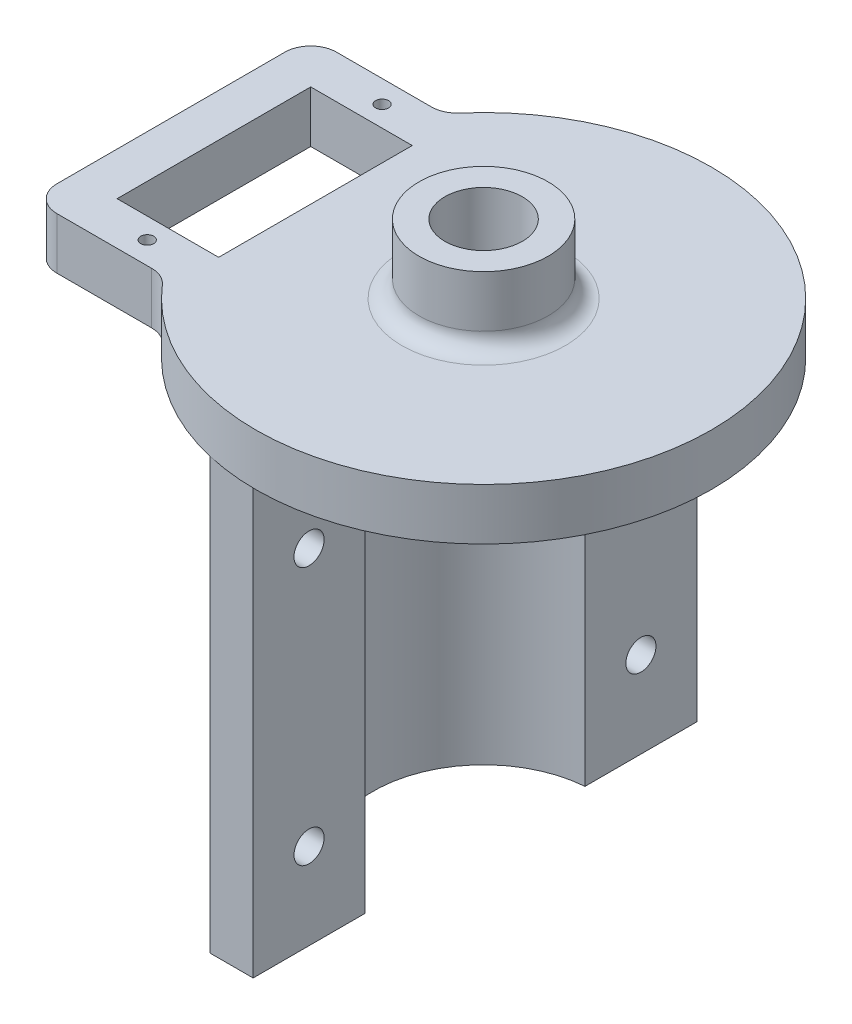
ISO-10303-21;
HEADER;
FILE_DESCRIPTION(('STEP AP214'),'2;1');
FILE_NAME('part.step','',(''),(''),'','','');
FILE_SCHEMA(('AUTOMOTIVE_DESIGN { 1 0 10303 214 1 1 1 1 }'));
ENDSEC;
DATA;
#1=APPLICATION_CONTEXT('core data for automotive mechanical design processes');
#2=APPLICATION_PROTOCOL_DEFINITION('international standard','automotive_design',2000,#1);
#3=PRODUCT_CONTEXT('',#1,'mechanical');
#4=PRODUCT('Part','Part','',(#3));
#5=PRODUCT_RELATED_PRODUCT_CATEGORY('part','',(#4));
#6=PRODUCT_DEFINITION_FORMATION('','',#4);
#7=PRODUCT_DEFINITION_CONTEXT('part definition',#1,'design');
#8=PRODUCT_DEFINITION('design','',#6,#7);
#9=PRODUCT_DEFINITION_SHAPE('','',#8);
#10=(LENGTH_UNIT() NAMED_UNIT(*) SI_UNIT(.MILLI.,.METRE.));
#11=(NAMED_UNIT(*) PLANE_ANGLE_UNIT() SI_UNIT($,.RADIAN.));
#12=(NAMED_UNIT(*) SI_UNIT($,.STERADIAN.) SOLID_ANGLE_UNIT());
#13=UNCERTAINTY_MEASURE_WITH_UNIT(LENGTH_MEASURE(1.E-05),#10,'distance_accuracy_value','');
#14=(GEOMETRIC_REPRESENTATION_CONTEXT(3) GLOBAL_UNCERTAINTY_ASSIGNED_CONTEXT((#13)) GLOBAL_UNIT_ASSIGNED_CONTEXT((#10,
#11,#12)) REPRESENTATION_CONTEXT('',''));
#15=CARTESIAN_POINT('',(0.,0.,0.));
#16=DIRECTION('',(0.,0.,1.));
#17=DIRECTION('',(1.,0.,0.));
#18=AXIS2_PLACEMENT_3D('',#15,#16,#17);
#19=CARTESIAN_POINT('',(-1.,-50.,25.7848331835619));
#20=DIRECTION('',(0.,0.,-1.));
#21=DIRECTION('',(-1.,0.,0.));
#22=AXIS2_PLACEMENT_3D('',#19,#20,#21);
#23=PLANE('',#22);
#24=DIRECTION('',(-1.,0.,0.));
#25=VECTOR('',#24,1.);
#26=CARTESIAN_POINT('',(-1.,0.,25.7848331835619));
#27=LINE('',#26,#25);
#28=CARTESIAN_POINT('',(-1.,0.,25.7848331835619));
#29=VERTEX_POINT('',#28);
#30=CARTESIAN_POINT('',(-6.,0.,25.7848331835619));
#31=VERTEX_POINT('',#30);
#32=EDGE_CURVE('E353',#29,#31,#27,.T.);
#33=ORIENTED_EDGE('',*,*,#32,.T.);
#34=DIRECTION('',(0.,1.,0.));
#35=VECTOR('',#34,1.);
#36=CARTESIAN_POINT('',(-6.,-50.,25.7848331835619));
#37=LINE('',#36,#35);
#38=CARTESIAN_POINT('',(-6.,-50.,25.7848331835619));
#39=VERTEX_POINT('',#38);
#40=EDGE_CURVE('E436',#39,#31,#37,.T.);
#41=ORIENTED_EDGE('',*,*,#40,.F.);
#42=DIRECTION('',(-1.,0.,0.));
#43=VECTOR('',#42,1.);
#44=CARTESIAN_POINT('',(-1.,-50.,25.7848331835619));
#45=LINE('',#44,#43);
#46=CARTESIAN_POINT('',(-1.,-50.,25.7848331835619));
#47=VERTEX_POINT('',#46);
#48=EDGE_CURVE('E354',#47,#39,#45,.T.);
#49=ORIENTED_EDGE('',*,*,#48,.F.);
#50=DIRECTION('',(0.,1.,0.));
#51=VECTOR('',#50,1.);
#52=CARTESIAN_POINT('',(-1.,-50.,25.7848331835619));
#53=LINE('',#52,#51);
#54=EDGE_CURVE('E378',#47,#29,#53,.T.);
#55=ORIENTED_EDGE('',*,*,#54,.T.);
#56=EDGE_LOOP('',(#33,#41,#49,#55));
#57=FACE_BOUND('',#56,.T.);
#58=ADVANCED_FACE('F45',(#57),#23,.F.);
#59=CARTESIAN_POINT('',(-6.,-50.,25.7848331835619));
#60=DIRECTION('',(1.,0.,0.));
#61=DIRECTION('',(0.,0.,-1.));
#62=AXIS2_PLACEMENT_3D('',#59,#60,#61);
#63=PLANE('',#62);
#64=CARTESIAN_POINT('',(-6.,-40.,19.2853936956035));
#65=DIRECTION('',(1.,0.,0.));
#66=DIRECTION('',(0.,0.,-1.));
#67=AXIS2_PLACEMENT_3D('',#64,#65,#66);
#68=CIRCLE('',#67,1.75);
#69=CARTESIAN_POINT('',(-6.,-40.,17.5353936956035));
#70=VERTEX_POINT('',#69);
#71=EDGE_CURVE('E341',#70,#70,#68,.T.);
#72=ORIENTED_EDGE('',*,*,#71,.T.);
#73=EDGE_LOOP('',(#72));
#74=FACE_BOUND('',#73,.T.);
#75=CARTESIAN_POINT('',(-6.,-10.,19.2853936956035));
#76=DIRECTION('',(1.,0.,0.));
#77=DIRECTION('',(0.,0.,-1.));
#78=AXIS2_PLACEMENT_3D('',#75,#76,#77);
#79=CIRCLE('',#78,1.75);
#80=CARTESIAN_POINT('',(-6.,-10.,17.5353936956035));
#81=VERTEX_POINT('',#80);
#82=EDGE_CURVE('E337',#81,#81,#79,.T.);
#83=ORIENTED_EDGE('',*,*,#82,.T.);
#84=EDGE_LOOP('',(#83));
#85=FACE_BOUND('',#84,.T.);
#86=DIRECTION('',(0.,0.,-1.));
#87=VECTOR('',#86,1.);
#88=CARTESIAN_POINT('',(-6.,0.,25.7848331835619));
#89=LINE('',#88,#87);
#90=CARTESIAN_POINT('',(-5.99999999999999,0.,16.7848331835619));
#91=VERTEX_POINT('',#90);
#92=EDGE_CURVE('E382',#31,#91,#89,.T.);
#93=ORIENTED_EDGE('',*,*,#92,.T.);
#94=DIRECTION('',(0.,1.,0.));
#95=VECTOR('',#94,1.);
#96=CARTESIAN_POINT('',(-5.99999999999999,-50.,16.7848331835619));
#97=LINE('',#96,#95);
#98=CARTESIAN_POINT('',(-5.99999999999999,-50.,16.7848331835619));
#99=VERTEX_POINT('',#98);
#100=EDGE_CURVE('E432',#99,#91,#97,.T.);
#101=ORIENTED_EDGE('',*,*,#100,.F.);
#102=DIRECTION('',(0.,0.,-1.));
#103=VECTOR('',#102,1.);
#104=CARTESIAN_POINT('',(-6.,-50.,25.7848331835619));
#105=LINE('',#104,#103);
#106=EDGE_CURVE('E357',#39,#99,#105,.T.);
#107=ORIENTED_EDGE('',*,*,#106,.F.);
#108=ORIENTED_EDGE('',*,*,#40,.T.);
#109=EDGE_LOOP('',(#93,#101,#107,#108));
#110=FACE_BOUND('',#109,.T.);
#111=ADVANCED_FACE('F462',(#74,#85,#110),#63,.F.);
#112=CARTESIAN_POINT('',(0.,-50.,0.));
#113=DIRECTION('',(0.,1.,0.));
#114=DIRECTION('',(0.,0.,1.));
#115=AXIS2_PLACEMENT_3D('',#112,#113,#114);
#116=CYLINDRICAL_SURFACE('',#115,17.825);
#117=CARTESIAN_POINT('',(0.,0.,0.));
#118=DIRECTION('',(0.,-1.,0.));
#119=DIRECTION('',(0.,0.,-1.));
#120=AXIS2_PLACEMENT_3D('',#117,#118,#119);
#121=CIRCLE('',#120,17.825);
#122=CARTESIAN_POINT('',(-6.,0.,-16.7848331835619));
#123=VERTEX_POINT('',#122);
#124=EDGE_CURVE('E386',#91,#123,#121,.T.);
#125=ORIENTED_EDGE('',*,*,#124,.T.);
#126=DIRECTION('',(0.,1.,0.));
#127=VECTOR('',#126,1.);
#128=CARTESIAN_POINT('',(-6.,-50.,-16.7848331835619));
#129=LINE('',#128,#127);
#130=CARTESIAN_POINT('',(-6.,-50.,-16.7848331835619));
#131=VERTEX_POINT('',#130);
#132=EDGE_CURVE('E428',#131,#123,#129,.T.);
#133=ORIENTED_EDGE('',*,*,#132,.F.);
#134=CARTESIAN_POINT('',(0.,-50.,0.));
#135=DIRECTION('',(0.,-1.,0.));
#136=DIRECTION('',(0.,0.,-1.));
#137=AXIS2_PLACEMENT_3D('',#134,#135,#136);
#138=CIRCLE('',#137,17.825);
#139=EDGE_CURVE('E361',#99,#131,#138,.T.);
#140=ORIENTED_EDGE('',*,*,#139,.F.);
#141=ORIENTED_EDGE('',*,*,#100,.T.);
#142=EDGE_LOOP('',(#125,#133,#140,#141));
#143=FACE_BOUND('',#142,.T.);
#144=ADVANCED_FACE('F468',(#143),#116,.T.);
#145=CARTESIAN_POINT('',(-6.,-50.,-16.7848331835619));
#146=DIRECTION('',(1.,0.,0.));
#147=DIRECTION('',(0.,0.,-1.));
#148=AXIS2_PLACEMENT_3D('',#145,#146,#147);
#149=PLANE('',#148);
#150=CARTESIAN_POINT('',(-6.,-10.,-19.2853936956035));
#151=DIRECTION('',(1.,0.,0.));
#152=DIRECTION('',(0.,0.,-1.));
#153=AXIS2_PLACEMENT_3D('',#150,#151,#152);
#154=CIRCLE('',#153,1.75000000000001);
#155=CARTESIAN_POINT('',(-6.,-10.,-21.0353936956035));
#156=VERTEX_POINT('',#155);
#157=EDGE_CURVE('E349',#156,#156,#154,.T.);
#158=ORIENTED_EDGE('',*,*,#157,.T.);
#159=EDGE_LOOP('',(#158));
#160=FACE_BOUND('',#159,.T.);
#161=CARTESIAN_POINT('',(-6.,-40.,-19.2853936956035));
#162=DIRECTION('',(1.,0.,0.));
#163=DIRECTION('',(0.,0.,-1.));
#164=AXIS2_PLACEMENT_3D('',#161,#162,#163);
#165=CIRCLE('',#164,1.75000000000001);
#166=CARTESIAN_POINT('',(-6.,-40.,-21.0353936956036));
#167=VERTEX_POINT('',#166);
#168=EDGE_CURVE('E345',#167,#167,#165,.T.);
#169=ORIENTED_EDGE('',*,*,#168,.T.);
#170=EDGE_LOOP('',(#169));
#171=FACE_BOUND('',#170,.T.);
#172=DIRECTION('',(0.,0.,-1.));
#173=VECTOR('',#172,1.);
#174=CARTESIAN_POINT('',(-6.,0.,-16.7848331835619));
#175=LINE('',#174,#173);
#176=CARTESIAN_POINT('',(-6.,0.,-25.7848331835619));
#177=VERTEX_POINT('',#176);
#178=EDGE_CURVE('E390',#123,#177,#175,.T.);
#179=ORIENTED_EDGE('',*,*,#178,.T.);
#180=DIRECTION('',(0.,1.,0.));
#181=VECTOR('',#180,1.);
#182=CARTESIAN_POINT('',(-6.,-50.,-25.7848331835619));
#183=LINE('',#182,#181);
#184=CARTESIAN_POINT('',(-6.,-50.,-25.7848331835619));
#185=VERTEX_POINT('',#184);
#186=EDGE_CURVE('E424',#185,#177,#183,.T.);
#187=ORIENTED_EDGE('',*,*,#186,.F.);
#188=DIRECTION('',(0.,0.,-1.));
#189=VECTOR('',#188,1.);
#190=CARTESIAN_POINT('',(-6.,-50.,-16.7848331835619));
#191=LINE('',#190,#189);
#192=EDGE_CURVE('E364',#131,#185,#191,.T.);
#193=ORIENTED_EDGE('',*,*,#192,.F.);
#194=ORIENTED_EDGE('',*,*,#132,.T.);
#195=EDGE_LOOP('',(#179,#187,#193,#194));
#196=FACE_BOUND('',#195,.T.);
#197=ADVANCED_FACE('F474',(#160,#171,#196),#149,.F.);
#198=CARTESIAN_POINT('',(-6.,-50.,-25.7848331835619));
#199=DIRECTION('',(0.,0.,1.));
#200=DIRECTION('',(1.,0.,0.));
#201=AXIS2_PLACEMENT_3D('',#198,#199,#200);
#202=PLANE('',#201);
#203=DIRECTION('',(1.,0.,0.));
#204=VECTOR('',#203,1.);
#205=CARTESIAN_POINT('',(-6.,0.,-25.7848331835619));
#206=LINE('',#205,#204);
#207=CARTESIAN_POINT('',(-1.,0.,-25.7848331835619));
#208=VERTEX_POINT('',#207);
#209=EDGE_CURVE('E394',#177,#208,#206,.T.);
#210=ORIENTED_EDGE('',*,*,#209,.T.);
#211=DIRECTION('',(0.,1.,0.));
#212=VECTOR('',#211,1.);
#213=CARTESIAN_POINT('',(-1.,-50.,-25.7848331835619));
#214=LINE('',#213,#212);
#215=CARTESIAN_POINT('',(-1.,-50.,-25.7848331835619));
#216=VERTEX_POINT('',#215);
#217=EDGE_CURVE('E420',#216,#208,#214,.T.);
#218=ORIENTED_EDGE('',*,*,#217,.F.);
#219=DIRECTION('',(1.,0.,0.));
#220=VECTOR('',#219,1.);
#221=CARTESIAN_POINT('',(-6.,-50.,-25.7848331835619));
#222=LINE('',#221,#220);
#223=EDGE_CURVE('E367',#185,#216,#222,.T.);
#224=ORIENTED_EDGE('',*,*,#223,.F.);
#225=ORIENTED_EDGE('',*,*,#186,.T.);
#226=EDGE_LOOP('',(#210,#218,#224,#225));
#227=FACE_BOUND('',#226,.T.);
#228=ADVANCED_FACE('F478',(#227),#202,.F.);
#229=CARTESIAN_POINT('',(-1.,-50.,-25.7848331835619));
#230=DIRECTION('',(-1.,0.,0.));
#231=DIRECTION('',(0.,0.,1.));
#232=AXIS2_PLACEMENT_3D('',#229,#230,#231);
#233=PLANE('',#232);
#234=CARTESIAN_POINT('',(-1.,-10.,-19.2853936956035));
#235=DIRECTION('',(1.,0.,0.));
#236=DIRECTION('',(0.,0.,1.));
#237=AXIS2_PLACEMENT_3D('',#234,#235,#236);
#238=CIRCLE('',#237,1.75000000000001);
#239=CARTESIAN_POINT('',(-1.,-10.,-17.5353936956035));
#240=VERTEX_POINT('',#239);
#241=EDGE_CURVE('E321',#240,#240,#238,.T.);
#242=ORIENTED_EDGE('',*,*,#241,.F.);
#243=EDGE_LOOP('',(#242));
#244=FACE_BOUND('',#243,.T.);
#245=CARTESIAN_POINT('',(-1.,-40.,-19.2853936956035));
#246=DIRECTION('',(1.,0.,0.));
#247=DIRECTION('',(0.,0.,-1.));
#248=AXIS2_PLACEMENT_3D('',#245,#246,#247);
#249=CIRCLE('',#248,1.75000000000001);
#250=CARTESIAN_POINT('',(-1.,-40.,-21.0353936956036));
#251=VERTEX_POINT('',#250);
#252=EDGE_CURVE('E327',#251,#251,#249,.T.);
#253=ORIENTED_EDGE('',*,*,#252,.F.);
#254=EDGE_LOOP('',(#253));
#255=FACE_BOUND('',#254,.T.);
#256=DIRECTION('',(0.,0.,1.));
#257=VECTOR('',#256,1.);
#258=CARTESIAN_POINT('',(-1.,0.,-25.7848331835619));
#259=LINE('',#258,#257);
#260=CARTESIAN_POINT('',(-1.00000000000001,0.,-12.7859542076452));
#261=VERTEX_POINT('',#260);
#262=EDGE_CURVE('E398',#208,#261,#259,.T.);
#263=ORIENTED_EDGE('',*,*,#262,.T.);
#264=DIRECTION('',(0.,1.,0.));
#265=VECTOR('',#264,1.);
#266=CARTESIAN_POINT('',(-1.00000000000001,-50.,-12.7859542076452));
#267=LINE('',#266,#265);
#268=CARTESIAN_POINT('',(-1.00000000000001,-50.,-12.7859542076452));
#269=VERTEX_POINT('',#268);
#270=EDGE_CURVE('E416',#269,#261,#267,.T.);
#271=ORIENTED_EDGE('',*,*,#270,.F.);
#272=DIRECTION('',(0.,0.,1.));
#273=VECTOR('',#272,1.);
#274=CARTESIAN_POINT('',(-1.,-50.,-25.7848331835619));
#275=LINE('',#274,#273);
#276=EDGE_CURVE('E370',#216,#269,#275,.T.);
#277=ORIENTED_EDGE('',*,*,#276,.F.);
#278=ORIENTED_EDGE('',*,*,#217,.T.);
#279=EDGE_LOOP('',(#263,#271,#277,#278));
#280=FACE_BOUND('',#279,.T.);
#281=ADVANCED_FACE('F482',(#244,#255,#280),#233,.F.);
#282=CARTESIAN_POINT('',(0.,-50.,0.));
#283=DIRECTION('',(0.,1.,0.));
#284=DIRECTION('',(0.,0.,1.));
#285=AXIS2_PLACEMENT_3D('',#282,#283,#284);
#286=CYLINDRICAL_SURFACE('',#285,12.825);
#287=CARTESIAN_POINT('',(0.,0.,0.));
#288=DIRECTION('',(0.,1.,0.));
#289=DIRECTION('',(0.,0.,-1.));
#290=AXIS2_PLACEMENT_3D('',#287,#288,#289);
#291=CIRCLE('',#290,12.825);
#292=CARTESIAN_POINT('',(-1.,0.,12.7859542076452));
#293=VERTEX_POINT('',#292);
#294=EDGE_CURVE('E402',#261,#293,#291,.T.);
#295=ORIENTED_EDGE('',*,*,#294,.T.);
#296=DIRECTION('',(0.,1.,0.));
#297=VECTOR('',#296,1.);
#298=CARTESIAN_POINT('',(-1.,-50.,12.7859542076452));
#299=LINE('',#298,#297);
#300=CARTESIAN_POINT('',(-1.,-50.,12.7859542076452));
#301=VERTEX_POINT('',#300);
#302=EDGE_CURVE('E412',#301,#293,#299,.T.);
#303=ORIENTED_EDGE('',*,*,#302,.F.);
#304=CARTESIAN_POINT('',(0.,-50.,0.));
#305=DIRECTION('',(0.,1.,0.));
#306=DIRECTION('',(0.,0.,-1.));
#307=AXIS2_PLACEMENT_3D('',#304,#305,#306);
#308=CIRCLE('',#307,12.825);
#309=EDGE_CURVE('E373',#269,#301,#308,.T.);
#310=ORIENTED_EDGE('',*,*,#309,.F.);
#311=ORIENTED_EDGE('',*,*,#270,.T.);
#312=EDGE_LOOP('',(#295,#303,#310,#311));
#313=FACE_BOUND('',#312,.T.);
#314=ADVANCED_FACE('F486',(#313),#286,.F.);
#315=CARTESIAN_POINT('',(-1.,-50.,25.7848331835619));
#316=DIRECTION('',(-1.,0.,0.));
#317=DIRECTION('',(0.,0.,1.));
#318=AXIS2_PLACEMENT_3D('',#315,#316,#317);
#319=PLANE('',#318);
#320=CARTESIAN_POINT('',(-1.,-40.,19.2853936956035));
#321=DIRECTION('',(1.,0.,0.));
#322=DIRECTION('',(0.,0.,1.));
#323=AXIS2_PLACEMENT_3D('',#320,#321,#322);
#324=CIRCLE('',#323,1.75);
#325=CARTESIAN_POINT('',(-1.,-40.,21.0353936956035));
#326=VERTEX_POINT('',#325);
#327=EDGE_CURVE('E322',#326,#326,#324,.T.);
#328=ORIENTED_EDGE('',*,*,#327,.F.);
#329=EDGE_LOOP('',(#328));
#330=FACE_BOUND('',#329,.T.);
#331=CARTESIAN_POINT('',(-1.,-10.,19.2853936956035));
#332=DIRECTION('',(1.,0.,0.));
#333=DIRECTION('',(0.,0.,-1.));
#334=AXIS2_PLACEMENT_3D('',#331,#332,#333);
#335=CIRCLE('',#334,1.75);
#336=CARTESIAN_POINT('',(-1.,-10.,17.5353936956035));
#337=VERTEX_POINT('',#336);
#338=EDGE_CURVE('E326',#337,#337,#335,.T.);
#339=ORIENTED_EDGE('',*,*,#338,.F.);
#340=EDGE_LOOP('',(#339));
#341=FACE_BOUND('',#340,.T.);
#342=DIRECTION('',(0.,0.,1.));
#343=VECTOR('',#342,1.);
#344=CARTESIAN_POINT('',(-1.,0.,25.7848331835619));
#345=LINE('',#344,#343);
#346=EDGE_CURVE('E358',#293,#29,#345,.T.);
#347=ORIENTED_EDGE('',*,*,#346,.T.);
#348=ORIENTED_EDGE('',*,*,#54,.F.);
#349=DIRECTION('',(0.,0.,1.));
#350=VECTOR('',#349,1.);
#351=CARTESIAN_POINT('',(-1.,-50.,25.7848331835619));
#352=LINE('',#351,#350);
#353=EDGE_CURVE('E62',#301,#47,#352,.T.);
#354=ORIENTED_EDGE('',*,*,#353,.F.);
#355=ORIENTED_EDGE('',*,*,#302,.T.);
#356=EDGE_LOOP('',(#347,#348,#354,#355));
#357=FACE_BOUND('',#356,.T.);
#358=ADVANCED_FACE('F490',(#330,#341,#357),#319,.F.);
#359=CARTESIAN_POINT('',(0.,-50.,0.));
#360=DIRECTION('',(0.,-1.,0.));
#361=DIRECTION('',(0.,0.,-1.));
#362=AXIS2_PLACEMENT_3D('',#359,#360,#361);
#363=PLANE('',#362);
#364=ORIENTED_EDGE('',*,*,#48,.T.);
#365=ORIENTED_EDGE('',*,*,#106,.T.);
#366=ORIENTED_EDGE('',*,*,#139,.T.);
#367=ORIENTED_EDGE('',*,*,#192,.T.);
#368=ORIENTED_EDGE('',*,*,#223,.T.);
#369=ORIENTED_EDGE('',*,*,#276,.T.);
#370=ORIENTED_EDGE('',*,*,#309,.T.);
#371=ORIENTED_EDGE('',*,*,#353,.T.);
#372=EDGE_LOOP('',(#364,#365,#366,#367,#368,#369,#370,#371));
#373=FACE_BOUND('',#372,.T.);
#374=ADVANCED_FACE('F494',(#373),#363,.T.);
#375=CARTESIAN_POINT('',(-17.825,-10.,19.2853936956035));
#376=DIRECTION('',(1.,0.,0.));
#377=DIRECTION('',(0.,0.,-1.));
#378=AXIS2_PLACEMENT_3D('',#375,#376,#377);
#379=CYLINDRICAL_SURFACE('',#378,1.75);
#380=ORIENTED_EDGE('',*,*,#338,.T.);
#381=EDGE_LOOP('',(#380));
#382=FACE_BOUND('',#381,.T.);
#383=ORIENTED_EDGE('',*,*,#82,.F.);
#384=EDGE_LOOP('',(#383));
#385=FACE_BOUND('',#384,.T.);
#386=ADVANCED_FACE('F498',(#382,#385),#379,.F.);
#387=CARTESIAN_POINT('',(-17.825,-40.,19.2853936956035));
#388=DIRECTION('',(1.,0.,0.));
#389=DIRECTION('',(0.,0.,-1.));
#390=AXIS2_PLACEMENT_3D('',#387,#388,#389);
#391=CYLINDRICAL_SURFACE('',#390,1.75);
#392=ORIENTED_EDGE('',*,*,#327,.T.);
#393=EDGE_LOOP('',(#392));
#394=FACE_BOUND('',#393,.T.);
#395=ORIENTED_EDGE('',*,*,#71,.F.);
#396=EDGE_LOOP('',(#395));
#397=FACE_BOUND('',#396,.T.);
#398=ADVANCED_FACE('F501',(#394,#397),#391,.F.);
#399=CARTESIAN_POINT('',(-17.825,-40.,-19.2853936956035));
#400=DIRECTION('',(1.,0.,0.));
#401=DIRECTION('',(0.,0.,-1.));
#402=AXIS2_PLACEMENT_3D('',#399,#400,#401);
#403=CYLINDRICAL_SURFACE('',#402,1.75000000000001);
#404=ORIENTED_EDGE('',*,*,#252,.T.);
#405=EDGE_LOOP('',(#404));
#406=FACE_BOUND('',#405,.T.);
#407=ORIENTED_EDGE('',*,*,#168,.F.);
#408=EDGE_LOOP('',(#407));
#409=FACE_BOUND('',#408,.T.);
#410=ADVANCED_FACE('F506',(#406,#409),#403,.F.);
#411=CARTESIAN_POINT('',(-17.825,-10.,-19.2853936956035));
#412=DIRECTION('',(1.,0.,0.));
#413=DIRECTION('',(0.,0.,-1.));
#414=AXIS2_PLACEMENT_3D('',#411,#412,#413);
#415=CYLINDRICAL_SURFACE('',#414,1.75000000000001);
#416=ORIENTED_EDGE('',*,*,#241,.T.);
#417=EDGE_LOOP('',(#416));
#418=FACE_BOUND('',#417,.T.);
#419=ORIENTED_EDGE('',*,*,#157,.F.);
#420=EDGE_LOOP('',(#419));
#421=FACE_BOUND('',#420,.T.);
#422=ADVANCED_FACE('F503',(#418,#421),#415,.F.);
#423=CARTESIAN_POINT('',(-22.3189922807748,0.,-19.25));
#424=DIRECTION('',(0.,1.,0.));
#425=DIRECTION('',(0.,0.,1.));
#426=AXIS2_PLACEMENT_3D('',#423,#424,#425);
#427=PLANE('',#426);
#428=CARTESIAN_POINT('',(0.,0.,0.));
#429=DIRECTION('',(0.,1.,0.));
#430=DIRECTION('',(0.,0.,1.));
#431=AXIS2_PLACEMENT_3D('',#428,#429,#430);
#432=CIRCLE('',#431,4.5);
#433=CARTESIAN_POINT('',(0.,0.,4.5));
#434=VERTEX_POINT('',#433);
#435=EDGE_CURVE('E848',#434,#434,#432,.T.);
#436=ORIENTED_EDGE('',*,*,#435,.T.);
#437=EDGE_LOOP('',(#436));
#438=FACE_BOUND('',#437,.T.);
#439=ORIENTED_EDGE('',*,*,#32,.F.);
#440=ORIENTED_EDGE('',*,*,#346,.F.);
#441=ORIENTED_EDGE('',*,*,#294,.F.);
#442=ORIENTED_EDGE('',*,*,#262,.F.);
#443=ORIENTED_EDGE('',*,*,#209,.F.);
#444=CARTESIAN_POINT('',(0.,0.,0.));
#445=DIRECTION('',(0.,1.,0.));
#446=DIRECTION('',(0.,0.,1.));
#447=AXIS2_PLACEMENT_3D('',#444,#445,#446);
#448=CIRCLE('',#447,26.4737156875289);
#449=EDGE_CURVE('E289',#31,#177,#448,.T.);
#450=ORIENTED_EDGE('',*,*,#449,.F.);
#451=EDGE_LOOP('',(#439,#440,#441,#442,#443,#450));
#452=FACE_BOUND('',#451,.T.);
#453=ADVANCED_FACE('F505',(#438,#452),#427,.F.);
#454=CARTESIAN_POINT('',(-25.443614130072,0.,13.65));
#455=DIRECTION('',(0.,1.,0.));
#456=DIRECTION('',(0.,0.,1.));
#457=AXIS2_PLACEMENT_3D('',#454,#455,#456);
#458=CIRCLE('',#457,0.749999999999998);
#459=CARTESIAN_POINT('',(-25.443614130072,0.,14.4));
#460=VERTEX_POINT('',#459);
#461=EDGE_CURVE('E777',#460,#460,#458,.T.);
#462=ORIENTED_EDGE('',*,*,#461,.T.);
#463=EDGE_LOOP('',(#462));
#464=FACE_BOUND('',#463,.T.);
#465=CARTESIAN_POINT('',(-25.443614130072,0.,-13.65));
#466=DIRECTION('',(0.,1.,0.));
#467=DIRECTION('',(0.,0.,1.));
#468=AXIS2_PLACEMENT_3D('',#465,#466,#467);
#469=CIRCLE('',#468,0.749999999999998);
#470=CARTESIAN_POINT('',(-25.443614130072,0.,-12.9));
#471=VERTEX_POINT('',#470);
#472=EDGE_CURVE('E781',#471,#471,#469,.T.);
#473=ORIENTED_EDGE('',*,*,#472,.T.);
#474=EDGE_LOOP('',(#473));
#475=FACE_BOUND('',#474,.T.);
#476=DIRECTION('',(0.,0.,1.));
#477=VECTOR('',#476,1.);
#478=CARTESIAN_POINT('',(-31.343614130072,0.,11.25));
#479=LINE('',#478,#477);
#480=CARTESIAN_POINT('',(-31.343614130072,0.,-11.25));
#481=VERTEX_POINT('',#480);
#482=CARTESIAN_POINT('',(-31.343614130072,0.,11.25));
#483=VERTEX_POINT('',#482);
#484=EDGE_CURVE('E217',#481,#483,#479,.T.);
#485=ORIENTED_EDGE('',*,*,#484,.T.);
#486=DIRECTION('',(1.,0.,0.));
#487=VECTOR('',#486,1.);
#488=CARTESIAN_POINT('',(-31.343614130072,0.,11.25));
#489=LINE('',#488,#487);
#490=CARTESIAN_POINT('',(-19.543614130072,0.,11.25));
#491=VERTEX_POINT('',#490);
#492=EDGE_CURVE('E198',#483,#491,#489,.T.);
#493=ORIENTED_EDGE('',*,*,#492,.T.);
#494=DIRECTION('',(0.,0.,-1.));
#495=VECTOR('',#494,1.);
#496=CARTESIAN_POINT('',(-19.543614130072,0.,11.25));
#497=LINE('',#496,#495);
#498=CARTESIAN_POINT('',(-19.543614130072,0.,-11.25));
#499=VERTEX_POINT('',#498);
#500=EDGE_CURVE('E223',#491,#499,#497,.T.);
#501=ORIENTED_EDGE('',*,*,#500,.T.);
#502=DIRECTION('',(-1.,0.,0.));
#503=VECTOR('',#502,1.);
#504=CARTESIAN_POINT('',(-31.343614130072,0.,-11.25));
#505=LINE('',#504,#503);
#506=EDGE_CURVE('E192',#499,#481,#505,.T.);
#507=ORIENTED_EDGE('',*,*,#506,.T.);
#508=EDGE_LOOP('',(#485,#493,#501,#507));
#509=FACE_BOUND('',#508,.T.);
#510=ORIENTED_EDGE('',*,*,#178,.F.);
#511=ORIENTED_EDGE('',*,*,#124,.F.);
#512=ORIENTED_EDGE('',*,*,#92,.F.);
#513=CARTESIAN_POINT('',(-20.0472401355014,0.,17.290627092551));
#514=VERTEX_POINT('',#513);
#515=EDGE_CURVE('E242',#514,#31,#448,.T.);
#516=ORIENTED_EDGE('',*,*,#515,.F.);
#517=CARTESIAN_POINT('',(-22.3189922807748,0.,19.25));
#518=DIRECTION('',(0.,-1.,0.));
#519=DIRECTION('',(0.,0.,-1.));
#520=AXIS2_PLACEMENT_3D('',#517,#518,#519);
#521=CIRCLE('',#520,3.);
#522=CARTESIAN_POINT('',(-22.3189922807748,0.,16.25));
#523=VERTEX_POINT('',#522);
#524=EDGE_CURVE('E282',#523,#514,#521,.T.);
#525=ORIENTED_EDGE('',*,*,#524,.F.);
#526=DIRECTION('',(1.,0.,0.));
#527=VECTOR('',#526,1.);
#528=CARTESIAN_POINT('',(-33.343614130072,0.,16.25));
#529=LINE('',#528,#527);
#530=CARTESIAN_POINT('',(-33.343614130072,0.,16.25));
#531=VERTEX_POINT('',#530);
#532=EDGE_CURVE('E279',#531,#523,#529,.T.);
#533=ORIENTED_EDGE('',*,*,#532,.F.);
#534=CARTESIAN_POINT('',(-33.343614130072,0.,13.25));
#535=DIRECTION('',(0.,1.,0.));
#536=DIRECTION('',(0.,0.,-1.));
#537=AXIS2_PLACEMENT_3D('',#534,#535,#536);
#538=CIRCLE('',#537,3.);
#539=CARTESIAN_POINT('',(-36.343614130072,0.,13.25));
#540=VERTEX_POINT('',#539);
#541=EDGE_CURVE('E276',#540,#531,#538,.T.);
#542=ORIENTED_EDGE('',*,*,#541,.F.);
#543=DIRECTION('',(0.,0.,1.));
#544=VECTOR('',#543,1.);
#545=CARTESIAN_POINT('',(-36.343614130072,0.,13.25));
#546=LINE('',#545,#544);
#547=CARTESIAN_POINT('',(-36.343614130072,0.,-13.25));
#548=VERTEX_POINT('',#547);
#549=EDGE_CURVE('E273',#548,#540,#546,.T.);
#550=ORIENTED_EDGE('',*,*,#549,.F.);
#551=CARTESIAN_POINT('',(-33.343614130072,0.,-13.25));
#552=DIRECTION('',(0.,1.,0.));
#553=DIRECTION('',(0.,0.,-1.));
#554=AXIS2_PLACEMENT_3D('',#551,#552,#553);
#555=CIRCLE('',#554,3.);
#556=CARTESIAN_POINT('',(-33.343614130072,0.,-16.25));
#557=VERTEX_POINT('',#556);
#558=EDGE_CURVE('E270',#557,#548,#555,.T.);
#559=ORIENTED_EDGE('',*,*,#558,.F.);
#560=DIRECTION('',(-1.,0.,0.));
#561=VECTOR('',#560,1.);
#562=CARTESIAN_POINT('',(-33.343614130072,0.,-16.25));
#563=LINE('',#562,#561);
#564=CARTESIAN_POINT('',(-22.3189922807748,0.,-16.25));
#565=VERTEX_POINT('',#564);
#566=EDGE_CURVE('E267',#565,#557,#563,.T.);
#567=ORIENTED_EDGE('',*,*,#566,.F.);
#568=CARTESIAN_POINT('',(-22.3189922807748,0.,-19.25));
#569=DIRECTION('',(0.,-1.,0.));
#570=DIRECTION('',(0.,0.,1.));
#571=AXIS2_PLACEMENT_3D('',#568,#569,#570);
#572=CIRCLE('',#571,3.);
#573=CARTESIAN_POINT('',(-20.0472401355014,0.,-17.290627092551));
#574=VERTEX_POINT('',#573);
#575=EDGE_CURVE('E200',#574,#565,#572,.T.);
#576=ORIENTED_EDGE('',*,*,#575,.F.);
#577=EDGE_CURVE('E285',#177,#574,#448,.T.);
#578=ORIENTED_EDGE('',*,*,#577,.F.);
#579=EDGE_LOOP('',(#510,#511,#512,#516,#525,#533,#542,#550,#559,#567,#576,#578));
#580=FACE_BOUND('',#579,.T.);
#581=ADVANCED_FACE('F547',(#464,#475,#509,#580),#427,.F.);
#582=CARTESIAN_POINT('',(-22.3189922807748,6.,-19.25));
#583=DIRECTION('',(0.,1.,0.));
#584=DIRECTION('',(0.,0.,1.));
#585=AXIS2_PLACEMENT_3D('',#582,#583,#584);
#586=PLANE('',#585);
#587=CARTESIAN_POINT('',(0.,6.,0.));
#588=DIRECTION('',(0.,1.,0.));
#589=DIRECTION('',(0.,0.,1.));
#590=AXIS2_PLACEMENT_3D('',#587,#588,#589);
#591=CIRCLE('',#590,9.5);
#592=CARTESIAN_POINT('',(0.,6.,9.5));
#593=VERTEX_POINT('',#592);
#594=EDGE_CURVE('E11',#593,#593,#591,.F.);
#595=ORIENTED_EDGE('',*,*,#594,.T.);
#596=EDGE_LOOP('',(#595));
#597=FACE_BOUND('',#596,.T.);
#598=CARTESIAN_POINT('',(-25.443614130072,6.,-13.65));
#599=DIRECTION('',(0.,1.,0.));
#600=DIRECTION('',(0.,0.,1.));
#601=AXIS2_PLACEMENT_3D('',#598,#599,#600);
#602=CIRCLE('',#601,0.749999999999998);
#603=CARTESIAN_POINT('',(-25.443614130072,6.,-12.9));
#604=VERTEX_POINT('',#603);
#605=EDGE_CURVE('E220',#604,#604,#602,.T.);
#606=ORIENTED_EDGE('',*,*,#605,.F.);
#607=EDGE_LOOP('',(#606));
#608=FACE_BOUND('',#607,.T.);
#609=CARTESIAN_POINT('',(-22.3189922807748,6.,-19.25));
#610=DIRECTION('',(0.,-1.,0.));
#611=DIRECTION('',(0.,0.,1.));
#612=AXIS2_PLACEMENT_3D('',#609,#610,#611);
#613=CIRCLE('',#612,3.);
#614=CARTESIAN_POINT('',(-20.0472401355014,6.,-17.290627092551));
#615=VERTEX_POINT('',#614);
#616=CARTESIAN_POINT('',(-22.3189922807748,6.,-16.25));
#617=VERTEX_POINT('',#616);
#618=EDGE_CURVE('E237',#615,#617,#613,.T.);
#619=ORIENTED_EDGE('',*,*,#618,.T.);
#620=DIRECTION('',(-1.,0.,0.));
#621=VECTOR('',#620,1.);
#622=CARTESIAN_POINT('',(-33.343614130072,6.,-16.25));
#623=LINE('',#622,#621);
#624=CARTESIAN_POINT('',(-33.343614130072,6.,-16.25));
#625=VERTEX_POINT('',#624);
#626=EDGE_CURVE('E241',#617,#625,#623,.T.);
#627=ORIENTED_EDGE('',*,*,#626,.T.);
#628=CARTESIAN_POINT('',(-33.343614130072,6.,-13.25));
#629=DIRECTION('',(0.,1.,0.));
#630=DIRECTION('',(0.,0.,-1.));
#631=AXIS2_PLACEMENT_3D('',#628,#629,#630);
#632=CIRCLE('',#631,3.);
#633=CARTESIAN_POINT('',(-36.343614130072,6.,-13.25));
#634=VERTEX_POINT('',#633);
#635=EDGE_CURVE('E245',#625,#634,#632,.T.);
#636=ORIENTED_EDGE('',*,*,#635,.T.);
#637=DIRECTION('',(0.,0.,1.));
#638=VECTOR('',#637,1.);
#639=CARTESIAN_POINT('',(-36.343614130072,6.,13.25));
#640=LINE('',#639,#638);
#641=CARTESIAN_POINT('',(-36.343614130072,6.,13.25));
#642=VERTEX_POINT('',#641);
#643=EDGE_CURVE('E248',#634,#642,#640,.T.);
#644=ORIENTED_EDGE('',*,*,#643,.T.);
#645=CARTESIAN_POINT('',(-33.343614130072,6.,13.25));
#646=DIRECTION('',(0.,1.,0.));
#647=DIRECTION('',(0.,0.,-1.));
#648=AXIS2_PLACEMENT_3D('',#645,#646,#647);
#649=CIRCLE('',#648,3.);
#650=CARTESIAN_POINT('',(-33.343614130072,6.,16.25));
#651=VERTEX_POINT('',#650);
#652=EDGE_CURVE('E251',#642,#651,#649,.T.);
#653=ORIENTED_EDGE('',*,*,#652,.T.);
#654=DIRECTION('',(1.,0.,0.));
#655=VECTOR('',#654,1.);
#656=CARTESIAN_POINT('',(-33.343614130072,6.,16.25));
#657=LINE('',#656,#655);
#658=CARTESIAN_POINT('',(-22.3189922807748,6.,16.25));
#659=VERTEX_POINT('',#658);
#660=EDGE_CURVE('E254',#651,#659,#657,.T.);
#661=ORIENTED_EDGE('',*,*,#660,.T.);
#662=CARTESIAN_POINT('',(-22.3189922807748,6.,19.25));
#663=DIRECTION('',(0.,-1.,0.));
#664=DIRECTION('',(0.,0.,-1.));
#665=AXIS2_PLACEMENT_3D('',#662,#663,#664);
#666=CIRCLE('',#665,3.);
#667=CARTESIAN_POINT('',(-20.0472401355014,6.,17.290627092551));
#668=VERTEX_POINT('',#667);
#669=EDGE_CURVE('E257',#659,#668,#666,.T.);
#670=ORIENTED_EDGE('',*,*,#669,.T.);
#671=CARTESIAN_POINT('',(0.,6.,0.));
#672=DIRECTION('',(0.,1.,0.));
#673=DIRECTION('',(0.,0.,1.));
#674=AXIS2_PLACEMENT_3D('',#671,#672,#673);
#675=CIRCLE('',#674,26.4737156875289);
#676=EDGE_CURVE('E260',#668,#615,#675,.T.);
#677=ORIENTED_EDGE('',*,*,#676,.T.);
#678=EDGE_LOOP('',(#619,#627,#636,#644,#653,#661,#670,#677));
#679=FACE_BOUND('',#678,.T.);
#680=DIRECTION('',(1.,0.,0.));
#681=VECTOR('',#680,1.);
#682=CARTESIAN_POINT('',(-31.343614130072,6.,11.25));
#683=LINE('',#682,#681);
#684=CARTESIAN_POINT('',(-31.343614130072,6.,11.25));
#685=VERTEX_POINT('',#684);
#686=CARTESIAN_POINT('',(-19.543614130072,6.,11.25));
#687=VERTEX_POINT('',#686);
#688=EDGE_CURVE('E191',#685,#687,#683,.T.);
#689=ORIENTED_EDGE('',*,*,#688,.F.);
#690=DIRECTION('',(0.,0.,1.));
#691=VECTOR('',#690,1.);
#692=CARTESIAN_POINT('',(-31.343614130072,6.,11.25));
#693=LINE('',#692,#691);
#694=CARTESIAN_POINT('',(-31.343614130072,6.,-11.25));
#695=VERTEX_POINT('',#694);
#696=EDGE_CURVE('E180',#695,#685,#693,.T.);
#697=ORIENTED_EDGE('',*,*,#696,.F.);
#698=DIRECTION('',(-1.,0.,0.));
#699=VECTOR('',#698,1.);
#700=CARTESIAN_POINT('',(-31.343614130072,6.,-11.25));
#701=LINE('',#700,#699);
#702=CARTESIAN_POINT('',(-19.543614130072,6.,-11.25));
#703=VERTEX_POINT('',#702);
#704=EDGE_CURVE('E211',#703,#695,#701,.T.);
#705=ORIENTED_EDGE('',*,*,#704,.F.);
#706=DIRECTION('',(0.,0.,-1.));
#707=VECTOR('',#706,1.);
#708=CARTESIAN_POINT('',(-19.543614130072,6.,11.25));
#709=LINE('',#708,#707);
#710=EDGE_CURVE('E207',#687,#703,#709,.T.);
#711=ORIENTED_EDGE('',*,*,#710,.F.);
#712=EDGE_LOOP('',(#689,#697,#705,#711));
#713=FACE_BOUND('',#712,.T.);
#714=CARTESIAN_POINT('',(-25.443614130072,6.,13.65));
#715=DIRECTION('',(0.,1.,0.));
#716=DIRECTION('',(0.,0.,1.));
#717=AXIS2_PLACEMENT_3D('',#714,#715,#716);
#718=CIRCLE('',#717,0.749999999999998);
#719=CARTESIAN_POINT('',(-25.443614130072,6.,14.4));
#720=VERTEX_POINT('',#719);
#721=EDGE_CURVE('E834',#720,#720,#718,.T.);
#722=ORIENTED_EDGE('',*,*,#721,.F.);
#723=EDGE_LOOP('',(#722));
#724=FACE_BOUND('',#723,.T.);
#725=ADVANCED_FACE('F204',(#597,#608,#679,#713,#724),#586,.T.);
#726=CARTESIAN_POINT('',(-22.3189922807748,6.,-19.25));
#727=DIRECTION('',(0.,-1.,0.));
#728=DIRECTION('',(0.,0.,-1.));
#729=AXIS2_PLACEMENT_3D('',#726,#727,#728);
#730=CYLINDRICAL_SURFACE('',#729,3.);
#731=ORIENTED_EDGE('',*,*,#575,.T.);
#732=DIRECTION('',(0.,-1.,0.));
#733=VECTOR('',#732,1.);
#734=CARTESIAN_POINT('',(-22.3189922807748,6.,-16.25));
#735=LINE('',#734,#733);
#736=EDGE_CURVE('E317',#617,#565,#735,.T.);
#737=ORIENTED_EDGE('',*,*,#736,.F.);
#738=ORIENTED_EDGE('',*,*,#618,.F.);
#739=DIRECTION('',(0.,-1.,0.));
#740=VECTOR('',#739,1.);
#741=CARTESIAN_POINT('',(-20.0472401355014,6.,-17.290627092551));
#742=LINE('',#741,#740);
#743=EDGE_CURVE('E263',#615,#574,#742,.T.);
#744=ORIENTED_EDGE('',*,*,#743,.T.);
#745=EDGE_LOOP('',(#731,#737,#738,#744));
#746=FACE_BOUND('',#745,.T.);
#747=ADVANCED_FACE('F514',(#746),#730,.F.);
#748=CARTESIAN_POINT('',(-33.343614130072,6.,-16.25));
#749=DIRECTION('',(0.,0.,1.));
#750=DIRECTION('',(1.,0.,0.));
#751=AXIS2_PLACEMENT_3D('',#748,#749,#750);
#752=PLANE('',#751);
#753=ORIENTED_EDGE('',*,*,#566,.T.);
#754=DIRECTION('',(0.,-1.,0.));
#755=VECTOR('',#754,1.);
#756=CARTESIAN_POINT('',(-33.343614130072,6.,-16.25));
#757=LINE('',#756,#755);
#758=EDGE_CURVE('E313',#625,#557,#757,.T.);
#759=ORIENTED_EDGE('',*,*,#758,.F.);
#760=ORIENTED_EDGE('',*,*,#626,.F.);
#761=ORIENTED_EDGE('',*,*,#736,.T.);
#762=EDGE_LOOP('',(#753,#759,#760,#761));
#763=FACE_BOUND('',#762,.T.);
#764=ADVANCED_FACE('F517',(#763),#752,.F.);
#765=CARTESIAN_POINT('',(-33.343614130072,6.,-13.25));
#766=DIRECTION('',(0.,-1.,0.));
#767=DIRECTION('',(0.,0.,-1.));
#768=AXIS2_PLACEMENT_3D('',#765,#766,#767);
#769=CYLINDRICAL_SURFACE('',#768,3.);
#770=ORIENTED_EDGE('',*,*,#558,.T.);
#771=DIRECTION('',(0.,-1.,0.));
#772=VECTOR('',#771,1.);
#773=CARTESIAN_POINT('',(-36.343614130072,6.,-13.25));
#774=LINE('',#773,#772);
#775=EDGE_CURVE('E309',#634,#548,#774,.T.);
#776=ORIENTED_EDGE('',*,*,#775,.F.);
#777=ORIENTED_EDGE('',*,*,#635,.F.);
#778=ORIENTED_EDGE('',*,*,#758,.T.);
#779=EDGE_LOOP('',(#770,#776,#777,#778));
#780=FACE_BOUND('',#779,.T.);
#781=ADVANCED_FACE('F521',(#780),#769,.T.);
#782=CARTESIAN_POINT('',(-36.343614130072,6.,13.25));
#783=DIRECTION('',(1.,0.,0.));
#784=DIRECTION('',(0.,0.,-1.));
#785=AXIS2_PLACEMENT_3D('',#782,#783,#784);
#786=PLANE('',#785);
#787=ORIENTED_EDGE('',*,*,#549,.T.);
#788=DIRECTION('',(0.,-1.,0.));
#789=VECTOR('',#788,1.);
#790=CARTESIAN_POINT('',(-36.343614130072,6.,13.25));
#791=LINE('',#790,#789);
#792=EDGE_CURVE('E305',#642,#540,#791,.T.);
#793=ORIENTED_EDGE('',*,*,#792,.F.);
#794=ORIENTED_EDGE('',*,*,#643,.F.);
#795=ORIENTED_EDGE('',*,*,#775,.T.);
#796=EDGE_LOOP('',(#787,#793,#794,#795));
#797=FACE_BOUND('',#796,.T.);
#798=ADVANCED_FACE('F525',(#797),#786,.F.);
#799=CARTESIAN_POINT('',(-33.343614130072,6.,13.25));
#800=DIRECTION('',(0.,-1.,0.));
#801=DIRECTION('',(0.,0.,-1.));
#802=AXIS2_PLACEMENT_3D('',#799,#800,#801);
#803=CYLINDRICAL_SURFACE('',#802,3.);
#804=ORIENTED_EDGE('',*,*,#541,.T.);
#805=DIRECTION('',(0.,-1.,0.));
#806=VECTOR('',#805,1.);
#807=CARTESIAN_POINT('',(-33.343614130072,6.,16.25));
#808=LINE('',#807,#806);
#809=EDGE_CURVE('E301',#651,#531,#808,.T.);
#810=ORIENTED_EDGE('',*,*,#809,.F.);
#811=ORIENTED_EDGE('',*,*,#652,.F.);
#812=ORIENTED_EDGE('',*,*,#792,.T.);
#813=EDGE_LOOP('',(#804,#810,#811,#812));
#814=FACE_BOUND('',#813,.T.);
#815=ADVANCED_FACE('F529',(#814),#803,.T.);
#816=CARTESIAN_POINT('',(-33.343614130072,6.,16.25));
#817=DIRECTION('',(0.,0.,-1.));
#818=DIRECTION('',(-1.,0.,0.));
#819=AXIS2_PLACEMENT_3D('',#816,#817,#818);
#820=PLANE('',#819);
#821=ORIENTED_EDGE('',*,*,#532,.T.);
#822=DIRECTION('',(0.,-1.,0.));
#823=VECTOR('',#822,1.);
#824=CARTESIAN_POINT('',(-22.3189922807748,6.,16.25));
#825=LINE('',#824,#823);
#826=EDGE_CURVE('E297',#659,#523,#825,.T.);
#827=ORIENTED_EDGE('',*,*,#826,.F.);
#828=ORIENTED_EDGE('',*,*,#660,.F.);
#829=ORIENTED_EDGE('',*,*,#809,.T.);
#830=EDGE_LOOP('',(#821,#827,#828,#829));
#831=FACE_BOUND('',#830,.T.);
#832=ADVANCED_FACE('F533',(#831),#820,.F.);
#833=CARTESIAN_POINT('',(-22.3189922807748,6.,19.25));
#834=DIRECTION('',(0.,-1.,0.));
#835=DIRECTION('',(0.,0.,-1.));
#836=AXIS2_PLACEMENT_3D('',#833,#834,#835);
#837=CYLINDRICAL_SURFACE('',#836,3.);
#838=ORIENTED_EDGE('',*,*,#524,.T.);
#839=DIRECTION('',(0.,-1.,0.));
#840=VECTOR('',#839,1.);
#841=CARTESIAN_POINT('',(-20.0472401355014,6.,17.290627092551));
#842=LINE('',#841,#840);
#843=EDGE_CURVE('E293',#668,#514,#842,.T.);
#844=ORIENTED_EDGE('',*,*,#843,.F.);
#845=ORIENTED_EDGE('',*,*,#669,.F.);
#846=ORIENTED_EDGE('',*,*,#826,.T.);
#847=EDGE_LOOP('',(#838,#844,#845,#846));
#848=FACE_BOUND('',#847,.T.);
#849=ADVANCED_FACE('F537',(#848),#837,.F.);
#850=CARTESIAN_POINT('',(0.,6.,0.));
#851=DIRECTION('',(0.,-1.,0.));
#852=DIRECTION('',(0.,0.,-1.));
#853=AXIS2_PLACEMENT_3D('',#850,#851,#852);
#854=CYLINDRICAL_SURFACE('',#853,26.4737156875289);
#855=ORIENTED_EDGE('',*,*,#515,.T.);
#856=ORIENTED_EDGE('',*,*,#449,.T.);
#857=ORIENTED_EDGE('',*,*,#577,.T.);
#858=ORIENTED_EDGE('',*,*,#743,.F.);
#859=ORIENTED_EDGE('',*,*,#676,.F.);
#860=ORIENTED_EDGE('',*,*,#843,.T.);
#861=EDGE_LOOP('',(#855,#856,#857,#858,#859,#860));
#862=FACE_BOUND('',#861,.T.);
#863=ADVANCED_FACE('F541',(#862),#854,.T.);
#864=CARTESIAN_POINT('',(-31.343614130072,6.,11.25));
#865=DIRECTION('',(1.,0.,0.));
#866=DIRECTION('',(0.,0.,-1.));
#867=AXIS2_PLACEMENT_3D('',#864,#865,#866);
#868=PLANE('',#867);
#869=ORIENTED_EDGE('',*,*,#484,.F.);
#870=DIRECTION('',(0.,-1.,0.));
#871=VECTOR('',#870,1.);
#872=CARTESIAN_POINT('',(-31.343614130072,6.,-11.25));
#873=LINE('',#872,#871);
#874=EDGE_CURVE('E186',#695,#481,#873,.T.);
#875=ORIENTED_EDGE('',*,*,#874,.F.);
#876=ORIENTED_EDGE('',*,*,#696,.T.);
#877=DIRECTION('',(0.,-1.,0.));
#878=VECTOR('',#877,1.);
#879=CARTESIAN_POINT('',(-31.343614130072,6.,11.25));
#880=LINE('',#879,#878);
#881=EDGE_CURVE('E183',#685,#483,#880,.T.);
#882=ORIENTED_EDGE('',*,*,#881,.T.);
#883=EDGE_LOOP('',(#869,#875,#876,#882));
#884=FACE_BOUND('',#883,.T.);
#885=ADVANCED_FACE('F182',(#884),#868,.T.);
#886=CARTESIAN_POINT('',(-31.343614130072,6.,11.25));
#887=DIRECTION('',(0.,0.,-1.));
#888=DIRECTION('',(-1.,0.,0.));
#889=AXIS2_PLACEMENT_3D('',#886,#887,#888);
#890=PLANE('',#889);
#891=ORIENTED_EDGE('',*,*,#492,.F.);
#892=ORIENTED_EDGE('',*,*,#881,.F.);
#893=ORIENTED_EDGE('',*,*,#688,.T.);
#894=DIRECTION('',(0.,-1.,0.));
#895=VECTOR('',#894,1.);
#896=CARTESIAN_POINT('',(-19.543614130072,6.,11.25));
#897=LINE('',#896,#895);
#898=EDGE_CURVE('E201',#687,#491,#897,.T.);
#899=ORIENTED_EDGE('',*,*,#898,.T.);
#900=EDGE_LOOP('',(#891,#892,#893,#899));
#901=FACE_BOUND('',#900,.T.);
#902=ADVANCED_FACE('F195',(#901),#890,.T.);
#903=CARTESIAN_POINT('',(-19.543614130072,6.,11.25));
#904=DIRECTION('',(-1.,0.,0.));
#905=DIRECTION('',(0.,0.,1.));
#906=AXIS2_PLACEMENT_3D('',#903,#904,#905);
#907=PLANE('',#906);
#908=ORIENTED_EDGE('',*,*,#500,.F.);
#909=ORIENTED_EDGE('',*,*,#898,.F.);
#910=ORIENTED_EDGE('',*,*,#710,.T.);
#911=DIRECTION('',(0.,-1.,0.));
#912=VECTOR('',#911,1.);
#913=CARTESIAN_POINT('',(-19.543614130072,6.,-11.25));
#914=LINE('',#913,#912);
#915=EDGE_CURVE('E232',#703,#499,#914,.T.);
#916=ORIENTED_EDGE('',*,*,#915,.T.);
#917=EDGE_LOOP('',(#908,#909,#910,#916));
#918=FACE_BOUND('',#917,.T.);
#919=ADVANCED_FACE('F556',(#918),#907,.T.);
#920=CARTESIAN_POINT('',(-31.343614130072,6.,-11.25));
#921=DIRECTION('',(0.,0.,1.));
#922=DIRECTION('',(1.,0.,0.));
#923=AXIS2_PLACEMENT_3D('',#920,#921,#922);
#924=PLANE('',#923);
#925=ORIENTED_EDGE('',*,*,#506,.F.);
#926=ORIENTED_EDGE('',*,*,#915,.F.);
#927=ORIENTED_EDGE('',*,*,#704,.T.);
#928=ORIENTED_EDGE('',*,*,#874,.T.);
#929=EDGE_LOOP('',(#925,#926,#927,#928));
#930=FACE_BOUND('',#929,.T.);
#931=ADVANCED_FACE('F559',(#930),#924,.T.);
#932=CARTESIAN_POINT('',(-25.443614130072,6.,-13.65));
#933=DIRECTION('',(0.,-1.,0.));
#934=DIRECTION('',(0.,0.,-1.));
#935=AXIS2_PLACEMENT_3D('',#932,#933,#934);
#936=CYLINDRICAL_SURFACE('',#935,0.749999999999998);
#937=ORIENTED_EDGE('',*,*,#605,.T.);
#938=EDGE_LOOP('',(#937));
#939=FACE_BOUND('',#938,.T.);
#940=ORIENTED_EDGE('',*,*,#472,.F.);
#941=EDGE_LOOP('',(#940));
#942=FACE_BOUND('',#941,.T.);
#943=ADVANCED_FACE('F563',(#939,#942),#936,.F.);
#944=CARTESIAN_POINT('',(-25.443614130072,6.,13.65));
#945=DIRECTION('',(0.,-1.,0.));
#946=DIRECTION('',(0.,0.,-1.));
#947=AXIS2_PLACEMENT_3D('',#944,#945,#946);
#948=CYLINDRICAL_SURFACE('',#947,0.749999999999998);
#949=ORIENTED_EDGE('',*,*,#721,.T.);
#950=EDGE_LOOP('',(#949));
#951=FACE_BOUND('',#950,.T.);
#952=ORIENTED_EDGE('',*,*,#461,.F.);
#953=EDGE_LOOP('',(#952));
#954=FACE_BOUND('',#953,.T.);
#955=ADVANCED_FACE('F567',(#951,#954),#948,.F.);
#956=CARTESIAN_POINT('',(0.,14.,0.));
#957=DIRECTION('',(0.,-1.,0.));
#958=DIRECTION('',(0.,0.,-1.));
#959=AXIS2_PLACEMENT_3D('',#956,#957,#958);
#960=CYLINDRICAL_SURFACE('',#959,7.5);
#961=CARTESIAN_POINT('',(0.,8.,0.));
#962=DIRECTION('',(0.,1.,0.));
#963=DIRECTION('',(0.,0.,1.));
#964=AXIS2_PLACEMENT_3D('',#961,#962,#963);
#965=CIRCLE('',#964,7.5);
#966=CARTESIAN_POINT('',(0.,8.,7.5));
#967=VERTEX_POINT('',#966);
#968=EDGE_CURVE('E55',#967,#967,#965,.T.);
#969=ORIENTED_EDGE('',*,*,#968,.T.);
#970=EDGE_LOOP('',(#969));
#971=FACE_BOUND('',#970,.T.);
#972=CARTESIAN_POINT('',(0.,14.,0.));
#973=DIRECTION('',(0.,1.,0.));
#974=DIRECTION('',(0.,0.,1.));
#975=AXIS2_PLACEMENT_3D('',#972,#973,#974);
#976=CIRCLE('',#975,7.5);
#977=CARTESIAN_POINT('',(0.,14.,7.5));
#978=VERTEX_POINT('',#977);
#979=EDGE_CURVE('E843',#978,#978,#976,.T.);
#980=ORIENTED_EDGE('',*,*,#979,.F.);
#981=EDGE_LOOP('',(#980));
#982=FACE_BOUND('',#981,.T.);
#983=ADVANCED_FACE('F443',(#971,#982),#960,.T.);
#984=CARTESIAN_POINT('',(0.,14.,0.));
#985=DIRECTION('',(0.,1.,0.));
#986=DIRECTION('',(0.,0.,1.));
#987=AXIS2_PLACEMENT_3D('',#984,#985,#986);
#988=PLANE('',#987);
#989=CARTESIAN_POINT('',(0.,14.,0.));
#990=DIRECTION('',(0.,1.,0.));
#991=DIRECTION('',(0.,0.,1.));
#992=AXIS2_PLACEMENT_3D('',#989,#990,#991);
#993=CIRCLE('',#992,4.5);
#994=CARTESIAN_POINT('',(0.,14.,4.5));
#995=VERTEX_POINT('',#994);
#996=EDGE_CURVE('E852',#995,#995,#993,.T.);
#997=ORIENTED_EDGE('',*,*,#996,.F.);
#998=EDGE_LOOP('',(#997));
#999=FACE_BOUND('',#998,.T.);
#1000=ORIENTED_EDGE('',*,*,#979,.T.);
#1001=EDGE_LOOP('',(#1000));
#1002=FACE_BOUND('',#1001,.T.);
#1003=ADVANCED_FACE('F448',(#999,#1002),#988,.T.);
#1004=CARTESIAN_POINT('',(0.,8.,0.));
#1005=DIRECTION('',(0.,1.,0.));
#1006=DIRECTION('',(0.,0.,1.));
#1007=AXIS2_PLACEMENT_3D('',#1004,#1005,#1006);
#1008=TOROIDAL_SURFACE('',#1007,9.5,2.);
#1009=ORIENTED_EDGE('',*,*,#594,.F.);
#1010=EDGE_LOOP('',(#1009));
#1011=FACE_BOUND('',#1010,.T.);
#1012=ORIENTED_EDGE('',*,*,#968,.F.);
#1013=EDGE_LOOP('',(#1012));
#1014=FACE_BOUND('',#1013,.T.);
#1015=ADVANCED_FACE('F47',(#1011,#1014),#1008,.F.);
#1016=CARTESIAN_POINT('',(0.,-50.,0.));
#1017=DIRECTION('',(0.,1.,0.));
#1018=DIRECTION('',(0.,0.,1.));
#1019=AXIS2_PLACEMENT_3D('',#1016,#1017,#1018);
#1020=CYLINDRICAL_SURFACE('',#1019,4.5);
#1021=ORIENTED_EDGE('',*,*,#996,.T.);
#1022=EDGE_LOOP('',(#1021));
#1023=FACE_BOUND('',#1022,.T.);
#1024=ORIENTED_EDGE('',*,*,#435,.F.);
#1025=EDGE_LOOP('',(#1024));
#1026=FACE_BOUND('',#1025,.T.);
#1027=ADVANCED_FACE('F447',(#1023,#1026),#1020,.F.);
#1028=CLOSED_SHELL('',(#58,#111,#144,#197,#228,#281,#314,#358,#374,#386,#398,#410,#422,#453,
#581,#725,#747,#764,#781,#798,#815,#832,#849,#863,#885,#902,#919,#931,#943,#955,#983,#1003,
#1015,#1027));
#1029=MANIFOLD_SOLID_BREP('B2',#1028);
#1030=ADVANCED_BREP_SHAPE_REPRESENTATION('',(#18,#1029),#14);
#1031=SHAPE_DEFINITION_REPRESENTATION(#9,#1030);
ENDSEC;
END-ISO-10303-21;
